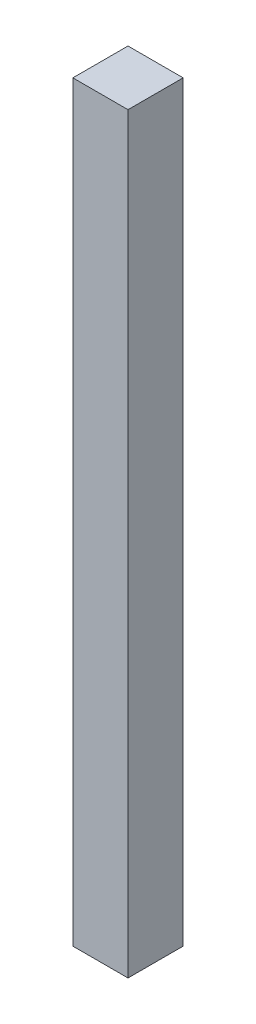
ISO-10303-21;
HEADER;
FILE_DESCRIPTION(('STEP AP214'),'2;1');
FILE_NAME('part.step','',(''),(''),'','','');
FILE_SCHEMA(('AUTOMOTIVE_DESIGN { 1 0 10303 214 1 1 1 1 }'));
ENDSEC;
DATA;
#1=APPLICATION_CONTEXT('core data for automotive mechanical design processes');
#2=APPLICATION_PROTOCOL_DEFINITION('international standard','automotive_design',2000,#1);
#3=PRODUCT_CONTEXT('',#1,'mechanical');
#4=PRODUCT('Part','Part','',(#3));
#5=PRODUCT_RELATED_PRODUCT_CATEGORY('part','',(#4));
#6=PRODUCT_DEFINITION_FORMATION('','',#4);
#7=PRODUCT_DEFINITION_CONTEXT('part definition',#1,'design');
#8=PRODUCT_DEFINITION('design','',#6,#7);
#9=PRODUCT_DEFINITION_SHAPE('','',#8);
#10=(LENGTH_UNIT() NAMED_UNIT(*) SI_UNIT(.MILLI.,.METRE.));
#11=(NAMED_UNIT(*) PLANE_ANGLE_UNIT() SI_UNIT($,.RADIAN.));
#12=(NAMED_UNIT(*) SI_UNIT($,.STERADIAN.) SOLID_ANGLE_UNIT());
#13=UNCERTAINTY_MEASURE_WITH_UNIT(LENGTH_MEASURE(1.E-05),#10,'distance_accuracy_value','');
#14=(GEOMETRIC_REPRESENTATION_CONTEXT(3) GLOBAL_UNCERTAINTY_ASSIGNED_CONTEXT((#13)) GLOBAL_UNIT_ASSIGNED_CONTEXT((#10,
#11,#12)) REPRESENTATION_CONTEXT('',''));
#15=CARTESIAN_POINT('',(0.,0.,0.));
#16=DIRECTION('',(0.,0.,1.));
#17=DIRECTION('',(1.,0.,0.));
#18=AXIS2_PLACEMENT_3D('',#15,#16,#17);
#19=CARTESIAN_POINT('',(4.,141.313708498985,-4.));
#20=DIRECTION('',(-1.,0.,0.));
#21=DIRECTION('',(0.,0.,1.));
#22=AXIS2_PLACEMENT_3D('',#19,#20,#21);
#23=PLANE('',#22);
#24=DIRECTION('',(0.,0.,-1.));
#25=VECTOR('',#24,1.);
#26=CARTESIAN_POINT('',(4.,130.,-4.));
#27=LINE('',#26,#25);
#28=CARTESIAN_POINT('',(4.,130.,4.));
#29=VERTEX_POINT('',#28);
#30=CARTESIAN_POINT('',(4.,130.,-4.));
#31=VERTEX_POINT('',#30);
#32=EDGE_CURVE('E98',#29,#31,#27,.T.);
#33=ORIENTED_EDGE('',*,*,#32,.F.);
#34=DIRECTION('',(0.,-1.,0.));
#35=VECTOR('',#34,1.);
#36=CARTESIAN_POINT('',(4.,141.313708498985,4.));
#37=LINE('',#36,#35);
#38=CARTESIAN_POINT('',(4.,20.9,4.));
#39=VERTEX_POINT('',#38);
#40=EDGE_CURVE('E37',#29,#39,#37,.T.);
#41=ORIENTED_EDGE('',*,*,#40,.T.);
#42=DIRECTION('',(0.,0.,-1.));
#43=VECTOR('',#42,1.);
#44=CARTESIAN_POINT('',(4.,20.9,-4.));
#45=LINE('',#44,#43);
#46=CARTESIAN_POINT('',(4.,20.9,-4.));
#47=VERTEX_POINT('',#46);
#48=EDGE_CURVE('E50',#39,#47,#45,.T.);
#49=ORIENTED_EDGE('',*,*,#48,.T.);
#50=DIRECTION('',(0.,-1.,0.));
#51=VECTOR('',#50,1.);
#52=CARTESIAN_POINT('',(4.,141.313708498985,-4.));
#53=LINE('',#52,#51);
#54=EDGE_CURVE('E94',#31,#47,#53,.T.);
#55=ORIENTED_EDGE('',*,*,#54,.F.);
#56=EDGE_LOOP('',(#33,#41,#49,#55));
#57=FACE_BOUND('',#56,.T.);
#58=ADVANCED_FACE('F33',(#57),#23,.F.);
#59=CARTESIAN_POINT('',(-4.,141.313708498985,-4.));
#60=DIRECTION('',(0.,0.,1.));
#61=DIRECTION('',(1.,0.,0.));
#62=AXIS2_PLACEMENT_3D('',#59,#60,#61);
#63=PLANE('',#62);
#64=DIRECTION('',(-1.,0.,0.));
#65=VECTOR('',#64,1.);
#66=CARTESIAN_POINT('',(-4.,130.,-4.));
#67=LINE('',#66,#65);
#68=CARTESIAN_POINT('',(-4.,130.,-4.));
#69=VERTEX_POINT('',#68);
#70=EDGE_CURVE('E42',#31,#69,#67,.T.);
#71=ORIENTED_EDGE('',*,*,#70,.F.);
#72=ORIENTED_EDGE('',*,*,#54,.T.);
#73=DIRECTION('',(-1.,0.,0.));
#74=VECTOR('',#73,1.);
#75=CARTESIAN_POINT('',(-4.,20.9,-4.));
#76=LINE('',#75,#74);
#77=CARTESIAN_POINT('',(-4.,20.9,-4.));
#78=VERTEX_POINT('',#77);
#79=EDGE_CURVE('E90',#47,#78,#76,.T.);
#80=ORIENTED_EDGE('',*,*,#79,.T.);
#81=DIRECTION('',(0.,-1.,0.));
#82=VECTOR('',#81,1.);
#83=CARTESIAN_POINT('',(-4.,141.313708498985,-4.));
#84=LINE('',#83,#82);
#85=EDGE_CURVE('E87',#69,#78,#84,.T.);
#86=ORIENTED_EDGE('',*,*,#85,.F.);
#87=EDGE_LOOP('',(#71,#72,#80,#86));
#88=FACE_BOUND('',#87,.T.);
#89=ADVANCED_FACE('F105',(#88),#63,.F.);
#90=CARTESIAN_POINT('',(-4.,141.313708498985,-4.));
#91=DIRECTION('',(1.,0.,0.));
#92=DIRECTION('',(0.,0.,-1.));
#93=AXIS2_PLACEMENT_3D('',#90,#91,#92);
#94=PLANE('',#93);
#95=DIRECTION('',(0.,0.,1.));
#96=VECTOR('',#95,1.);
#97=CARTESIAN_POINT('',(-4.,130.,-4.));
#98=LINE('',#97,#96);
#99=CARTESIAN_POINT('',(-4.,130.,4.));
#100=VERTEX_POINT('',#99);
#101=EDGE_CURVE('E11',#69,#100,#98,.T.);
#102=ORIENTED_EDGE('',*,*,#101,.F.);
#103=ORIENTED_EDGE('',*,*,#85,.T.);
#104=DIRECTION('',(0.,0.,1.));
#105=VECTOR('',#104,1.);
#106=CARTESIAN_POINT('',(-4.,20.9,-4.));
#107=LINE('',#106,#105);
#108=CARTESIAN_POINT('',(-4.,20.9,4.));
#109=VERTEX_POINT('',#108);
#110=EDGE_CURVE('E77',#78,#109,#107,.T.);
#111=ORIENTED_EDGE('',*,*,#110,.T.);
#112=DIRECTION('',(0.,-1.,0.));
#113=VECTOR('',#112,1.);
#114=CARTESIAN_POINT('',(-4.,141.313708498985,4.));
#115=LINE('',#114,#113);
#116=EDGE_CURVE('E80',#100,#109,#115,.T.);
#117=ORIENTED_EDGE('',*,*,#116,.F.);
#118=EDGE_LOOP('',(#102,#103,#111,#117));
#119=FACE_BOUND('',#118,.T.);
#120=ADVANCED_FACE('F85',(#119),#94,.F.);
#121=CARTESIAN_POINT('',(-4.,141.313708498985,4.));
#122=DIRECTION('',(0.,0.,-1.));
#123=DIRECTION('',(-1.,0.,0.));
#124=AXIS2_PLACEMENT_3D('',#121,#122,#123);
#125=PLANE('',#124);
#126=DIRECTION('',(1.,0.,0.));
#127=VECTOR('',#126,1.);
#128=CARTESIAN_POINT('',(-4.,130.,4.));
#129=LINE('',#128,#127);
#130=EDGE_CURVE('E79',#100,#29,#129,.T.);
#131=ORIENTED_EDGE('',*,*,#130,.F.);
#132=ORIENTED_EDGE('',*,*,#116,.T.);
#133=DIRECTION('',(1.,0.,0.));
#134=VECTOR('',#133,1.);
#135=CARTESIAN_POINT('',(-4.,20.9,4.));
#136=LINE('',#135,#134);
#137=EDGE_CURVE('E73',#109,#39,#136,.T.);
#138=ORIENTED_EDGE('',*,*,#137,.T.);
#139=ORIENTED_EDGE('',*,*,#40,.F.);
#140=EDGE_LOOP('',(#131,#132,#138,#139));
#141=FACE_BOUND('',#140,.T.);
#142=ADVANCED_FACE('F82',(#141),#125,.F.);
#143=CARTESIAN_POINT('',(0.,130.,0.));
#144=DIRECTION('',(0.,1.,0.));
#145=DIRECTION('',(0.,0.,1.));
#146=AXIS2_PLACEMENT_3D('',#143,#144,#145);
#147=PLANE('',#146);
#148=ORIENTED_EDGE('',*,*,#130,.T.);
#149=ORIENTED_EDGE('',*,*,#32,.T.);
#150=ORIENTED_EDGE('',*,*,#70,.T.);
#151=ORIENTED_EDGE('',*,*,#101,.T.);
#152=EDGE_LOOP('',(#148,#149,#150,#151));
#153=FACE_BOUND('',#152,.T.);
#154=ADVANCED_FACE('F35',(#153),#147,.T.);
#155=CARTESIAN_POINT('',(0.,20.9,0.));
#156=DIRECTION('',(0.,1.,0.));
#157=DIRECTION('',(0.,0.,1.));
#158=AXIS2_PLACEMENT_3D('',#155,#156,#157);
#159=PLANE('',#158);
#160=ORIENTED_EDGE('',*,*,#137,.F.);
#161=ORIENTED_EDGE('',*,*,#110,.F.);
#162=ORIENTED_EDGE('',*,*,#79,.F.);
#163=ORIENTED_EDGE('',*,*,#48,.F.);
#164=EDGE_LOOP('',(#160,#161,#162,#163));
#165=FACE_BOUND('',#164,.T.);
#166=ADVANCED_FACE('F75',(#165),#159,.F.);
#167=CLOSED_SHELL('',(#58,#89,#120,#142,#154,#166));
#168=MANIFOLD_SOLID_BREP('B2',#167);
#169=ADVANCED_BREP_SHAPE_REPRESENTATION('',(#18,#168),#14);
#170=SHAPE_DEFINITION_REPRESENTATION(#9,#169);
ENDSEC;
END-ISO-10303-21;
